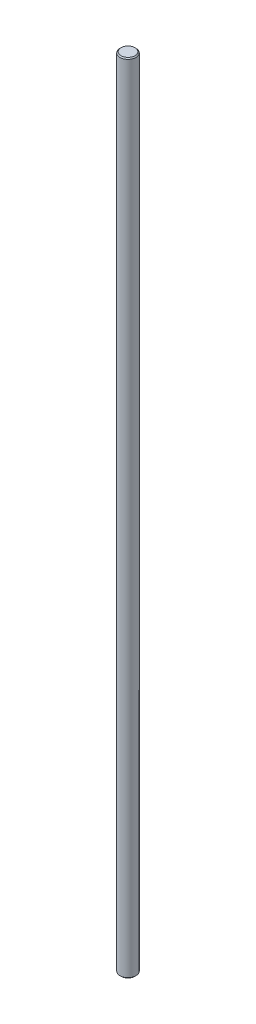
ISO-10303-21;
HEADER;
FILE_DESCRIPTION(('STEP AP214'),'2;1');
FILE_NAME('part.step','',(''),(''),'','','');
FILE_SCHEMA(('AUTOMOTIVE_DESIGN { 1 0 10303 214 1 1 1 1 }'));
ENDSEC;
DATA;
#1=APPLICATION_CONTEXT('core data for automotive mechanical design processes');
#2=APPLICATION_PROTOCOL_DEFINITION('international standard','automotive_design',2000,#1);
#3=PRODUCT_CONTEXT('',#1,'mechanical');
#4=PRODUCT('Part','Part','',(#3));
#5=PRODUCT_RELATED_PRODUCT_CATEGORY('part','',(#4));
#6=PRODUCT_DEFINITION_FORMATION('','',#4);
#7=PRODUCT_DEFINITION_CONTEXT('part definition',#1,'design');
#8=PRODUCT_DEFINITION('design','',#6,#7);
#9=PRODUCT_DEFINITION_SHAPE('','',#8);
#10=(LENGTH_UNIT() NAMED_UNIT(*) SI_UNIT(.MILLI.,.METRE.));
#11=(NAMED_UNIT(*) PLANE_ANGLE_UNIT() SI_UNIT($,.RADIAN.));
#12=(NAMED_UNIT(*) SI_UNIT($,.STERADIAN.) SOLID_ANGLE_UNIT());
#13=UNCERTAINTY_MEASURE_WITH_UNIT(LENGTH_MEASURE(1.E-05),#10,'distance_accuracy_value','');
#14=(GEOMETRIC_REPRESENTATION_CONTEXT(3) GLOBAL_UNCERTAINTY_ASSIGNED_CONTEXT((#13)) GLOBAL_UNIT_ASSIGNED_CONTEXT((#10,
#11,#12)) REPRESENTATION_CONTEXT('',''));
#15=CARTESIAN_POINT('',(0.,0.,0.));
#16=DIRECTION('',(0.,0.,1.));
#17=DIRECTION('',(1.,0.,0.));
#18=AXIS2_PLACEMENT_3D('',#15,#16,#17);
#19=CARTESIAN_POINT('',(0.,400.,0.));
#20=DIRECTION('',(0.,-1.,0.));
#21=DIRECTION('',(0.,0.,-1.));
#22=AXIS2_PLACEMENT_3D('',#19,#20,#21);
#23=CYLINDRICAL_SURFACE('',#22,4.);
#24=CARTESIAN_POINT('',(0.,0.508000000000119,0.));
#25=DIRECTION('',(0.,1.,0.));
#26=DIRECTION('',(0.,0.,1.));
#27=AXIS2_PLACEMENT_3D('',#24,#25,#26);
#28=CIRCLE('',#27,4.);
#29=CARTESIAN_POINT('',(0.,0.508000000000119,4.));
#30=VERTEX_POINT('',#29);
#31=EDGE_CURVE('E53',#30,#30,#28,.T.);
#32=ORIENTED_EDGE('',*,*,#31,.T.);
#33=EDGE_LOOP('',(#32));
#34=FACE_BOUND('',#33,.T.);
#35=CARTESIAN_POINT('',(0.,399.492,0.));
#36=DIRECTION('',(0.,1.,0.));
#37=DIRECTION('',(0.,0.,1.));
#38=AXIS2_PLACEMENT_3D('',#35,#36,#37);
#39=CIRCLE('',#38,4.);
#40=CARTESIAN_POINT('',(0.,399.492,4.));
#41=VERTEX_POINT('',#40);
#42=EDGE_CURVE('E58',#41,#41,#39,.F.);
#43=ORIENTED_EDGE('',*,*,#42,.T.);
#44=EDGE_LOOP('',(#43));
#45=FACE_BOUND('',#44,.T.);
#46=ADVANCED_FACE('F39',(#34,#45),#23,.T.);
#47=CARTESIAN_POINT('',(0.,400.,0.));
#48=DIRECTION('',(0.,1.,0.));
#49=DIRECTION('',(0.,0.,1.));
#50=AXIS2_PLACEMENT_3D('',#47,#48,#49);
#51=PLANE('',#50);
#52=CARTESIAN_POINT('',(0.,400.,0.));
#53=DIRECTION('',(0.,1.,0.));
#54=DIRECTION('',(0.,0.,1.));
#55=AXIS2_PLACEMENT_3D('',#52,#53,#54);
#56=CIRCLE('',#55,3.49199999999994);
#57=CARTESIAN_POINT('',(0.,400.,3.49199999999994));
#58=VERTEX_POINT('',#57);
#59=EDGE_CURVE('E10',#58,#58,#56,.T.);
#60=ORIENTED_EDGE('',*,*,#59,.T.);
#61=EDGE_LOOP('',(#60));
#62=FACE_BOUND('',#61,.T.);
#63=ADVANCED_FACE('F75',(#62),#51,.T.);
#64=CARTESIAN_POINT('',(0.,0.,0.));
#65=DIRECTION('',(0.,1.,0.));
#66=DIRECTION('',(0.,0.,1.));
#67=AXIS2_PLACEMENT_3D('',#64,#65,#66);
#68=PLANE('',#67);
#69=CARTESIAN_POINT('',(0.,0.,0.));
#70=DIRECTION('',(0.,1.,0.));
#71=DIRECTION('',(0.,0.,1.));
#72=AXIS2_PLACEMENT_3D('',#69,#70,#71);
#73=CIRCLE('',#72,3.49199999999994);
#74=CARTESIAN_POINT('',(0.,0.,3.49199999999994));
#75=VERTEX_POINT('',#74);
#76=EDGE_CURVE('E48',#75,#75,#73,.F.);
#77=ORIENTED_EDGE('',*,*,#76,.T.);
#78=EDGE_LOOP('',(#77));
#79=FACE_BOUND('',#78,.T.);
#80=ADVANCED_FACE('F72',(#79),#68,.F.);
#81=CARTESIAN_POINT('',(0.,0.508000000000119,0.));
#82=DIRECTION('',(0.,1.,0.));
#83=DIRECTION('',(0.,0.,1.));
#84=AXIS2_PLACEMENT_3D('',#81,#82,#83);
#85=CONICAL_SURFACE('',#84,4.,0.78539816339739);
#86=ORIENTED_EDGE('',*,*,#76,.F.);
#87=EDGE_LOOP('',(#86));
#88=FACE_BOUND('',#87,.T.);
#89=ORIENTED_EDGE('',*,*,#31,.F.);
#90=EDGE_LOOP('',(#89));
#91=FACE_BOUND('',#90,.T.);
#92=ADVANCED_FACE('F68',(#88,#91),#85,.T.);
#93=CARTESIAN_POINT('',(0.,400.,0.));
#94=DIRECTION('',(0.,-1.,0.));
#95=DIRECTION('',(0.,0.,-1.));
#96=AXIS2_PLACEMENT_3D('',#93,#94,#95);
#97=CONICAL_SURFACE('',#96,3.49199999999994,0.785398163397445);
#98=ORIENTED_EDGE('',*,*,#42,.F.);
#99=EDGE_LOOP('',(#98));
#100=FACE_BOUND('',#99,.T.);
#101=ORIENTED_EDGE('',*,*,#59,.F.);
#102=EDGE_LOOP('',(#101));
#103=FACE_BOUND('',#102,.T.);
#104=ADVANCED_FACE('F42',(#100,#103),#97,.T.);
#105=CLOSED_SHELL('',(#46,#63,#80,#92,#104));
#106=MANIFOLD_SOLID_BREP('B2',#105);
#107=ADVANCED_BREP_SHAPE_REPRESENTATION('',(#18,#106),#14);
#108=SHAPE_DEFINITION_REPRESENTATION(#9,#107);
ENDSEC;
END-ISO-10303-21;
